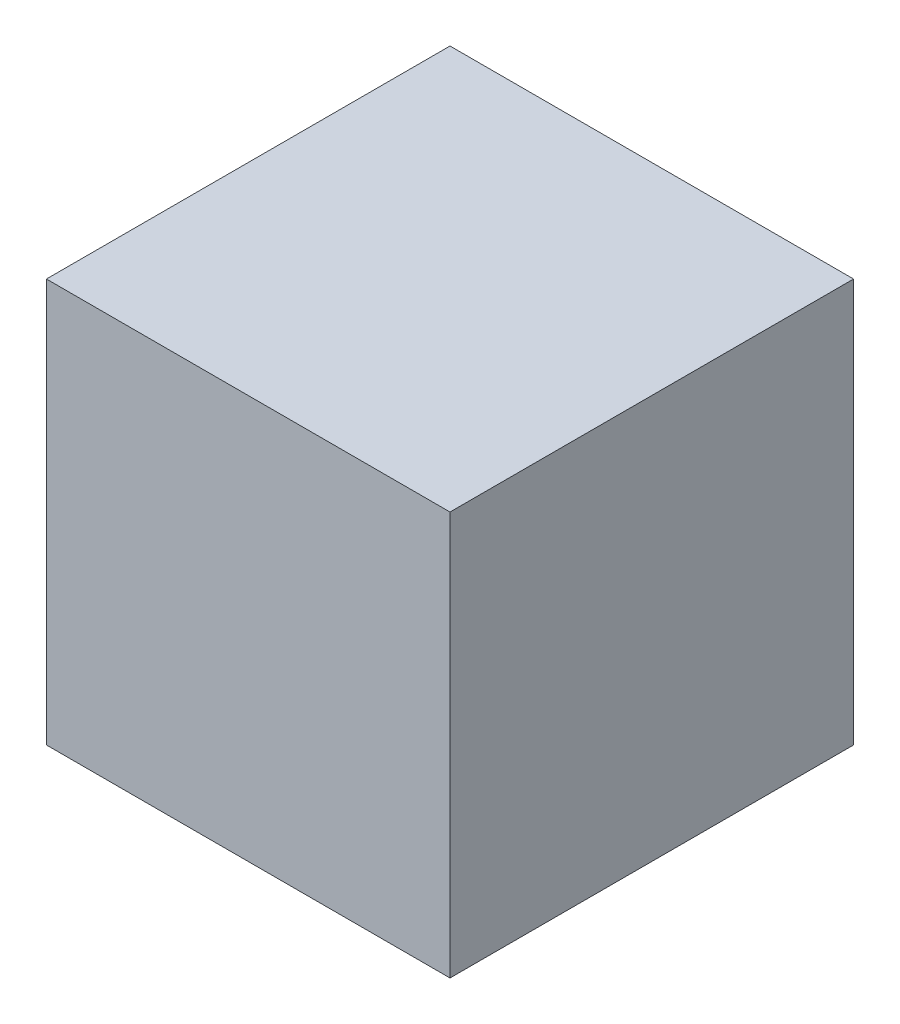
ISO-10303-21;
HEADER;
FILE_DESCRIPTION(('STEP AP214'),'2;1');
FILE_NAME('part.step','',(''),(''),'','','');
FILE_SCHEMA(('AUTOMOTIVE_DESIGN { 1 0 10303 214 1 1 1 1 }'));
ENDSEC;
DATA;
#1=APPLICATION_CONTEXT('core data for automotive mechanical design processes');
#2=APPLICATION_PROTOCOL_DEFINITION('international standard','automotive_design',2000,#1);
#3=PRODUCT_CONTEXT('',#1,'mechanical');
#4=PRODUCT('Part','Part','',(#3));
#5=PRODUCT_RELATED_PRODUCT_CATEGORY('part','',(#4));
#6=PRODUCT_DEFINITION_FORMATION('','',#4);
#7=PRODUCT_DEFINITION_CONTEXT('part definition',#1,'design');
#8=PRODUCT_DEFINITION('design','',#6,#7);
#9=PRODUCT_DEFINITION_SHAPE('','',#8);
#10=(LENGTH_UNIT() NAMED_UNIT(*) SI_UNIT(.MILLI.,.METRE.));
#11=(NAMED_UNIT(*) PLANE_ANGLE_UNIT() SI_UNIT($,.RADIAN.));
#12=(NAMED_UNIT(*) SI_UNIT($,.STERADIAN.) SOLID_ANGLE_UNIT());
#13=UNCERTAINTY_MEASURE_WITH_UNIT(LENGTH_MEASURE(1.E-05),#10,'distance_accuracy_value','');
#14=(GEOMETRIC_REPRESENTATION_CONTEXT(3) GLOBAL_UNCERTAINTY_ASSIGNED_CONTEXT((#13)) GLOBAL_UNIT_ASSIGNED_CONTEXT((#10,
#11,#12)) REPRESENTATION_CONTEXT('',''));
#15=CARTESIAN_POINT('',(0.,0.,0.));
#16=DIRECTION('',(0.,0.,1.));
#17=DIRECTION('',(1.,0.,0.));
#18=AXIS2_PLACEMENT_3D('',#15,#16,#17);
#19=CARTESIAN_POINT('',(400.,0.,0.));
#20=DIRECTION('',(0.,0.,-1.));
#21=DIRECTION('',(0.,1.,0.));
#22=AXIS2_PLACEMENT_3D('',#19,#20,#21);
#23=PLANE('',#22);
#24=DIRECTION('',(0.,-1.,0.));
#25=VECTOR('',#24,1.);
#26=CARTESIAN_POINT('',(0.,0.,0.));
#27=LINE('',#26,#25);
#28=CARTESIAN_POINT('',(0.,400.,1.11022302462516E-13));
#29=VERTEX_POINT('',#28);
#30=CARTESIAN_POINT('',(0.,0.,0.));
#31=VERTEX_POINT('',#30);
#32=EDGE_CURVE('E97',#29,#31,#27,.T.);
#33=ORIENTED_EDGE('',*,*,#32,.T.);
#34=DIRECTION('',(-1.,0.,0.));
#35=VECTOR('',#34,1.);
#36=CARTESIAN_POINT('',(400.,0.,0.));
#37=LINE('',#36,#35);
#38=CARTESIAN_POINT('',(400.,0.,0.));
#39=VERTEX_POINT('',#38);
#40=EDGE_CURVE('E11',#39,#31,#37,.T.);
#41=ORIENTED_EDGE('',*,*,#40,.F.);
#42=DIRECTION('',(0.,-1.,0.));
#43=VECTOR('',#42,1.);
#44=CARTESIAN_POINT('',(400.,0.,0.));
#45=LINE('',#44,#43);
#46=CARTESIAN_POINT('',(400.,400.,1.11022302462516E-13));
#47=VERTEX_POINT('',#46);
#48=EDGE_CURVE('E85',#47,#39,#45,.T.);
#49=ORIENTED_EDGE('',*,*,#48,.F.);
#50=DIRECTION('',(-1.,0.,0.));
#51=VECTOR('',#50,1.);
#52=CARTESIAN_POINT('',(400.,400.,1.11022302462516E-13));
#53=LINE('',#52,#51);
#54=EDGE_CURVE('E93',#47,#29,#53,.T.);
#55=ORIENTED_EDGE('',*,*,#54,.T.);
#56=EDGE_LOOP('',(#33,#41,#49,#55));
#57=FACE_BOUND('',#56,.T.);
#58=ADVANCED_FACE('F34',(#57),#23,.F.);
#59=CARTESIAN_POINT('',(400.,0.,0.));
#60=DIRECTION('',(0.,1.,0.));
#61=DIRECTION('',(0.,0.,1.));
#62=AXIS2_PLACEMENT_3D('',#59,#60,#61);
#63=PLANE('',#62);
#64=DIRECTION('',(0.,0.,-1.));
#65=VECTOR('',#64,1.);
#66=CARTESIAN_POINT('',(0.,0.,0.));
#67=LINE('',#66,#65);
#68=CARTESIAN_POINT('',(0.,0.,-400.));
#69=VERTEX_POINT('',#68);
#70=EDGE_CURVE('E89',#31,#69,#67,.T.);
#71=ORIENTED_EDGE('',*,*,#70,.T.);
#72=DIRECTION('',(-1.,0.,0.));
#73=VECTOR('',#72,1.);
#74=CARTESIAN_POINT('',(400.,0.,-400.));
#75=LINE('',#74,#73);
#76=CARTESIAN_POINT('',(400.,0.,-400.));
#77=VERTEX_POINT('',#76);
#78=EDGE_CURVE('E42',#77,#69,#75,.T.);
#79=ORIENTED_EDGE('',*,*,#78,.F.);
#80=DIRECTION('',(0.,0.,-1.));
#81=VECTOR('',#80,1.);
#82=CARTESIAN_POINT('',(400.,0.,0.));
#83=LINE('',#82,#81);
#84=EDGE_CURVE('E80',#39,#77,#83,.T.);
#85=ORIENTED_EDGE('',*,*,#84,.F.);
#86=ORIENTED_EDGE('',*,*,#40,.T.);
#87=EDGE_LOOP('',(#71,#79,#85,#86));
#88=FACE_BOUND('',#87,.T.);
#89=ADVANCED_FACE('F88',(#88),#63,.F.);
#90=CARTESIAN_POINT('',(400.,0.,-400.));
#91=DIRECTION('',(0.,0.,1.));
#92=DIRECTION('',(0.,-1.,0.));
#93=AXIS2_PLACEMENT_3D('',#90,#91,#92);
#94=PLANE('',#93);
#95=DIRECTION('',(0.,1.,0.));
#96=VECTOR('',#95,1.);
#97=CARTESIAN_POINT('',(0.,0.,-400.));
#98=LINE('',#97,#96);
#99=CARTESIAN_POINT('',(0.,400.,-400.));
#100=VERTEX_POINT('',#99);
#101=EDGE_CURVE('E67',#69,#100,#98,.T.);
#102=ORIENTED_EDGE('',*,*,#101,.T.);
#103=DIRECTION('',(-1.,0.,0.));
#104=VECTOR('',#103,1.);
#105=CARTESIAN_POINT('',(400.,400.,-400.));
#106=LINE('',#105,#104);
#107=CARTESIAN_POINT('',(400.,400.,-400.));
#108=VERTEX_POINT('',#107);
#109=EDGE_CURVE('E90',#108,#100,#106,.T.);
#110=ORIENTED_EDGE('',*,*,#109,.F.);
#111=DIRECTION('',(0.,1.,0.));
#112=VECTOR('',#111,1.);
#113=CARTESIAN_POINT('',(400.,0.,-400.));
#114=LINE('',#113,#112);
#115=EDGE_CURVE('E83',#77,#108,#114,.T.);
#116=ORIENTED_EDGE('',*,*,#115,.F.);
#117=ORIENTED_EDGE('',*,*,#78,.T.);
#118=EDGE_LOOP('',(#102,#110,#116,#117));
#119=FACE_BOUND('',#118,.T.);
#120=ADVANCED_FACE('F91',(#119),#94,.F.);
#121=CARTESIAN_POINT('',(400.,400.,1.11022302462516E-13));
#122=DIRECTION('',(0.,-1.,0.));
#123=DIRECTION('',(0.,0.,-1.));
#124=AXIS2_PLACEMENT_3D('',#121,#122,#123);
#125=PLANE('',#124);
#126=DIRECTION('',(0.,0.,1.));
#127=VECTOR('',#126,1.);
#128=CARTESIAN_POINT('',(0.,400.,1.11022302462516E-13));
#129=LINE('',#128,#127);
#130=EDGE_CURVE('E73',#100,#29,#129,.T.);
#131=ORIENTED_EDGE('',*,*,#130,.T.);
#132=ORIENTED_EDGE('',*,*,#54,.F.);
#133=DIRECTION('',(0.,0.,1.));
#134=VECTOR('',#133,1.);
#135=CARTESIAN_POINT('',(400.,400.,1.11022302462516E-13));
#136=LINE('',#135,#134);
#137=EDGE_CURVE('E50',#108,#47,#136,.T.);
#138=ORIENTED_EDGE('',*,*,#137,.F.);
#139=ORIENTED_EDGE('',*,*,#109,.T.);
#140=EDGE_LOOP('',(#131,#132,#138,#139));
#141=FACE_BOUND('',#140,.T.);
#142=ADVANCED_FACE('F104',(#141),#125,.F.);
#143=CARTESIAN_POINT('',(400.,0.,0.));
#144=DIRECTION('',(-1.,0.,0.));
#145=DIRECTION('',(0.,0.,1.));
#146=AXIS2_PLACEMENT_3D('',#143,#144,#145);
#147=PLANE('',#146);
#148=ORIENTED_EDGE('',*,*,#48,.T.);
#149=ORIENTED_EDGE('',*,*,#84,.T.);
#150=ORIENTED_EDGE('',*,*,#115,.T.);
#151=ORIENTED_EDGE('',*,*,#137,.T.);
#152=EDGE_LOOP('',(#148,#149,#150,#151));
#153=FACE_BOUND('',#152,.T.);
#154=ADVANCED_FACE('F81',(#153),#147,.F.);
#155=CARTESIAN_POINT('',(0.,0.,0.));
#156=DIRECTION('',(-1.,0.,0.));
#157=DIRECTION('',(0.,0.,1.));
#158=AXIS2_PLACEMENT_3D('',#155,#156,#157);
#159=PLANE('',#158);
#160=ORIENTED_EDGE('',*,*,#32,.F.);
#161=ORIENTED_EDGE('',*,*,#130,.F.);
#162=ORIENTED_EDGE('',*,*,#101,.F.);
#163=ORIENTED_EDGE('',*,*,#70,.F.);
#164=EDGE_LOOP('',(#160,#161,#162,#163));
#165=FACE_BOUND('',#164,.T.);
#166=ADVANCED_FACE('F107',(#165),#159,.T.);
#167=CLOSED_SHELL('',(#58,#89,#120,#142,#154,#166));
#168=MANIFOLD_SOLID_BREP('B2',#167);
#169=ADVANCED_BREP_SHAPE_REPRESENTATION('',(#18,#168),#14);
#170=SHAPE_DEFINITION_REPRESENTATION(#9,#169);
ENDSEC;
END-ISO-10303-21;
